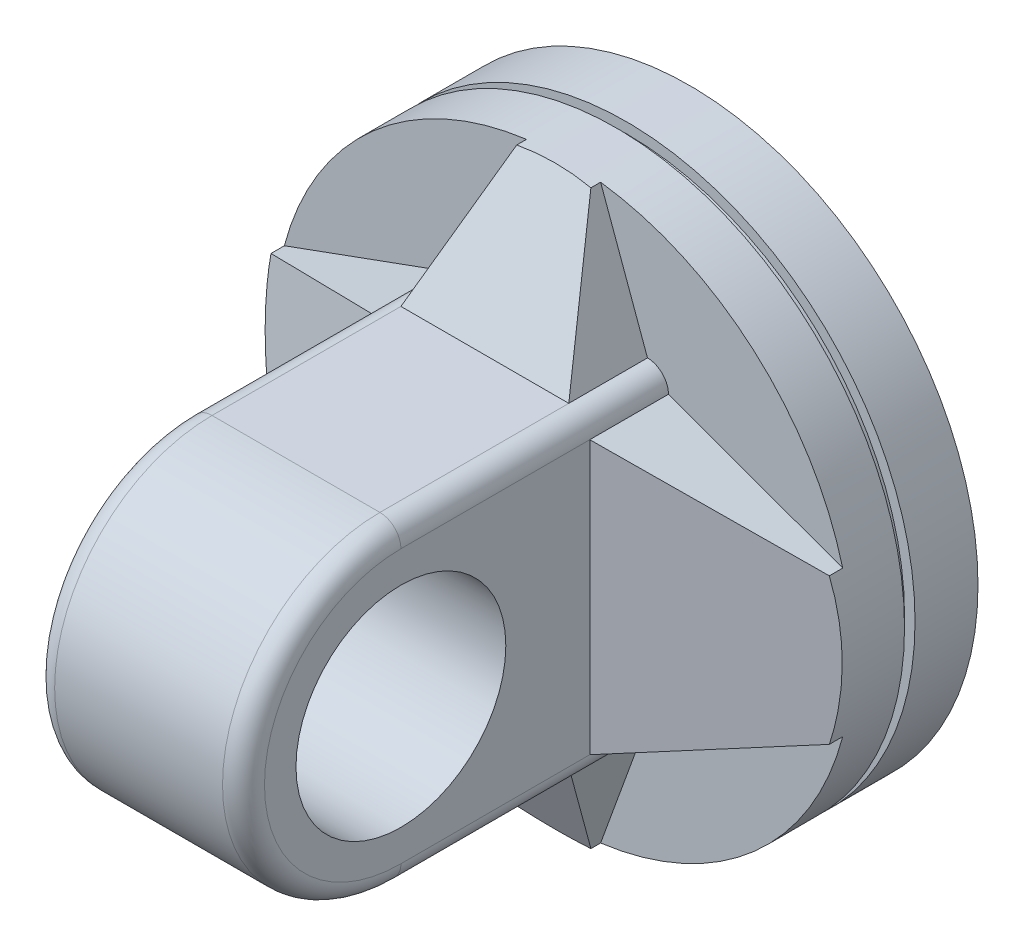
ISO-10303-21;
HEADER;
FILE_DESCRIPTION(('STEP AP214'),'2;1');
FILE_NAME('part.step','',(''),(''),'','','');
FILE_SCHEMA(('AUTOMOTIVE_DESIGN { 1 0 10303 214 1 1 1 1 }'));
ENDSEC;
DATA;
#1=APPLICATION_CONTEXT('core data for automotive mechanical design processes');
#2=APPLICATION_PROTOCOL_DEFINITION('international standard','automotive_design',2000,#1);
#3=PRODUCT_CONTEXT('',#1,'mechanical');
#4=PRODUCT('Part','Part','',(#3));
#5=PRODUCT_RELATED_PRODUCT_CATEGORY('part','',(#4));
#6=PRODUCT_DEFINITION_FORMATION('','',#4);
#7=PRODUCT_DEFINITION_CONTEXT('part definition',#1,'design');
#8=PRODUCT_DEFINITION('design','',#6,#7);
#9=PRODUCT_DEFINITION_SHAPE('','',#8);
#10=(LENGTH_UNIT() NAMED_UNIT(*) SI_UNIT(.MILLI.,.METRE.));
#11=(NAMED_UNIT(*) PLANE_ANGLE_UNIT() SI_UNIT($,.RADIAN.));
#12=(NAMED_UNIT(*) SI_UNIT($,.STERADIAN.) SOLID_ANGLE_UNIT());
#13=UNCERTAINTY_MEASURE_WITH_UNIT(LENGTH_MEASURE(1.E-05),#10,'distance_accuracy_value','');
#14=(GEOMETRIC_REPRESENTATION_CONTEXT(3) GLOBAL_UNCERTAINTY_ASSIGNED_CONTEXT((#13)) GLOBAL_UNIT_ASSIGNED_CONTEXT((#10,
#11,#12)) REPRESENTATION_CONTEXT('',''));
#15=CARTESIAN_POINT('',(0.,0.,0.));
#16=DIRECTION('',(0.,0.,1.));
#17=DIRECTION('',(1.,0.,0.));
#18=AXIS2_PLACEMENT_3D('',#15,#16,#17);
#19=CARTESIAN_POINT('',(0.,0.,120.));
#20=DIRECTION('',(0.,0.,1.));
#21=DIRECTION('',(1.,0.,0.));
#22=AXIS2_PLACEMENT_3D('',#19,#20,#21);
#23=PLANE('',#22);
#24=CARTESIAN_POINT('',(0.,0.,120.));
#25=DIRECTION('',(0.,0.,1.));
#26=DIRECTION('',(1.,0.,0.));
#27=AXIS2_PLACEMENT_3D('',#24,#25,#26);
#28=CIRCLE('',#27,275.);
#29=CARTESIAN_POINT('',(-266.057108102886,-69.5601554622265,120.));
#30=VERTEX_POINT('',#29);
#31=CARTESIAN_POINT('',(-35.3333345813136,-272.720654640174,120.));
#32=VERTEX_POINT('',#31);
#33=EDGE_CURVE('E270',#30,#32,#28,.T.);
#34=ORIENTED_EDGE('',*,*,#33,.T.);
#35=DIRECTION('',(0.342020143325671,-0.939692620785907,0.));
#36=VECTOR('',#35,1.);
#37=CARTESIAN_POINT('',(-118.85084845125,-43.2581711535386,120.));
#38=LINE('',#37,#36);
#39=CARTESIAN_POINT('',(-80.,-150.,120.));
#40=VERTEX_POINT('',#39);
#41=EDGE_CURVE('E183',#40,#32,#38,.T.);
#42=ORIENTED_EDGE('',*,*,#41,.F.);
#43=CARTESIAN_POINT('',(-80.,-130.,120.));
#44=DIRECTION('',(0.,0.,1.));
#45=DIRECTION('',(1.,0.,0.));
#46=AXIS2_PLACEMENT_3D('',#43,#44,#45);
#47=CIRCLE('',#46,20.);
#48=CARTESIAN_POINT('',(-100.,-130.,120.));
#49=VERTEX_POINT('',#48);
#50=EDGE_CURVE('E11',#40,#49,#47,.F.);
#51=ORIENTED_EDGE('',*,*,#50,.T.);
#52=DIRECTION('',(-0.939692620785912,0.34202014332566,0.));
#53=VECTOR('',#52,1.);
#54=CARTESIAN_POINT('',(-53.4789724736748,-146.932269287061,120.));
#55=LINE('',#54,#53);
#56=EDGE_CURVE('E348',#49,#30,#55,.T.);
#57=ORIENTED_EDGE('',*,*,#56,.T.);
#58=EDGE_LOOP('',(#34,#42,#51,#57));
#59=FACE_BOUND('',#58,.T.);
#60=ADVANCED_FACE('F34',(#59),#23,.T.);
#61=CARTESIAN_POINT('',(266.057108102887,69.5601554622248,120.));
#62=VERTEX_POINT('',#61);
#63=CARTESIAN_POINT('',(35.3333345813155,272.720654640174,120.));
#64=VERTEX_POINT('',#63);
#65=EDGE_CURVE('E274',#62,#64,#28,.T.);
#66=ORIENTED_EDGE('',*,*,#65,.T.);
#67=DIRECTION('',(-0.342020143325665,0.93969262078591,0.));
#68=VECTOR('',#67,1.);
#69=CARTESIAN_POINT('',(118.85084845125,43.2581711535378,120.));
#70=LINE('',#69,#68);
#71=CARTESIAN_POINT('',(80.,150.,120.));
#72=VERTEX_POINT('',#71);
#73=EDGE_CURVE('E318',#72,#64,#70,.T.);
#74=ORIENTED_EDGE('',*,*,#73,.F.);
#75=CARTESIAN_POINT('',(80.,130.,120.));
#76=DIRECTION('',(0.,0.,1.));
#77=DIRECTION('',(1.,0.,0.));
#78=AXIS2_PLACEMENT_3D('',#75,#76,#77);
#79=CIRCLE('',#78,20.);
#80=CARTESIAN_POINT('',(100.,130.,120.));
#81=VERTEX_POINT('',#80);
#82=EDGE_CURVE('E230',#72,#81,#79,.F.);
#83=ORIENTED_EDGE('',*,*,#82,.T.);
#84=DIRECTION('',(0.939692620785909,-0.342020143325666,0.));
#85=VECTOR('',#84,1.);
#86=CARTESIAN_POINT('',(53.4789724736758,146.932269287061,120.));
#87=LINE('',#86,#85);
#88=EDGE_CURVE('E330',#81,#62,#87,.T.);
#89=ORIENTED_EDGE('',*,*,#88,.T.);
#90=EDGE_LOOP('',(#66,#74,#83,#89));
#91=FACE_BOUND('',#90,.T.);
#92=ADVANCED_FACE('F377',(#91),#23,.T.);
#93=DIRECTION('',(-0.342020143325665,-0.93969262078591,0.));
#94=VECTOR('',#93,1.);
#95=CARTESIAN_POINT('',(118.85084845125,-43.2581711535378,120.));
#96=LINE('',#95,#94);
#97=CARTESIAN_POINT('',(80.,-150.,120.));
#98=VERTEX_POINT('',#97);
#99=CARTESIAN_POINT('',(35.3333345813155,-272.720654640174,120.));
#100=VERTEX_POINT('',#99);
#101=EDGE_CURVE('E397',#98,#100,#96,.T.);
#102=ORIENTED_EDGE('',*,*,#101,.T.);
#103=CARTESIAN_POINT('',(266.057108102887,-69.5601554622248,120.));
#104=VERTEX_POINT('',#103);
#105=EDGE_CURVE('E273',#100,#104,#28,.T.);
#106=ORIENTED_EDGE('',*,*,#105,.T.);
#107=DIRECTION('',(0.939692620785909,0.342020143325666,0.));
#108=VECTOR('',#107,1.);
#109=CARTESIAN_POINT('',(53.4789724736758,-146.932269287061,120.));
#110=LINE('',#109,#108);
#111=CARTESIAN_POINT('',(100.,-130.,120.));
#112=VERTEX_POINT('',#111);
#113=EDGE_CURVE('E334',#112,#104,#110,.T.);
#114=ORIENTED_EDGE('',*,*,#113,.F.);
#115=CARTESIAN_POINT('',(80.,-130.,120.));
#116=DIRECTION('',(0.,0.,1.));
#117=DIRECTION('',(1.,0.,0.));
#118=AXIS2_PLACEMENT_3D('',#115,#116,#117);
#119=CIRCLE('',#118,20.);
#120=EDGE_CURVE('E232',#112,#98,#119,.F.);
#121=ORIENTED_EDGE('',*,*,#120,.T.);
#122=EDGE_LOOP('',(#102,#106,#114,#121));
#123=FACE_BOUND('',#122,.T.);
#124=ADVANCED_FACE('F382',(#123),#23,.T.);
#125=DIRECTION('',(0.342020143325671,0.939692620785907,0.));
#126=VECTOR('',#125,1.);
#127=CARTESIAN_POINT('',(-118.85084845125,43.2581711535386,120.));
#128=LINE('',#127,#126);
#129=CARTESIAN_POINT('',(-80.,150.,120.));
#130=VERTEX_POINT('',#129);
#131=CARTESIAN_POINT('',(-35.3333345813136,272.720654640174,120.));
#132=VERTEX_POINT('',#131);
#133=EDGE_CURVE('E200',#130,#132,#128,.T.);
#134=ORIENTED_EDGE('',*,*,#133,.T.);
#135=CARTESIAN_POINT('',(-266.057108102887,69.5601554622229,120.));
#136=VERTEX_POINT('',#135);
#137=EDGE_CURVE('E277',#132,#136,#28,.T.);
#138=ORIENTED_EDGE('',*,*,#137,.T.);
#139=DIRECTION('',(-0.939692620785907,-0.342020143325672,0.));
#140=VECTOR('',#139,1.);
#141=CARTESIAN_POINT('',(-53.4789724736765,146.93226928706,120.));
#142=LINE('',#141,#140);
#143=CARTESIAN_POINT('',(-100.,130.,120.));
#144=VERTEX_POINT('',#143);
#145=EDGE_CURVE('E345',#144,#136,#142,.T.);
#146=ORIENTED_EDGE('',*,*,#145,.F.);
#147=CARTESIAN_POINT('',(-80.,130.,120.));
#148=DIRECTION('',(0.,0.,1.));
#149=DIRECTION('',(1.,0.,0.));
#150=AXIS2_PLACEMENT_3D('',#147,#148,#149);
#151=CIRCLE('',#150,20.);
#152=EDGE_CURVE('E43',#144,#130,#151,.F.);
#153=ORIENTED_EDGE('',*,*,#152,.T.);
#154=EDGE_LOOP('',(#134,#138,#146,#153));
#155=FACE_BOUND('',#154,.T.);
#156=ADVANCED_FACE('F378',(#155),#23,.T.);
#157=CARTESIAN_POINT('',(0.,0.,70.));
#158=DIRECTION('',(0.,0.,-1.));
#159=DIRECTION('',(-1.,0.,0.));
#160=AXIS2_PLACEMENT_3D('',#157,#158,#159);
#161=CYLINDRICAL_SURFACE('',#160,275.);
#162=CARTESIAN_POINT('',(0.,0.,0.));
#163=DIRECTION('',(0.,0.,1.));
#164=DIRECTION('',(1.,0.,0.));
#165=AXIS2_PLACEMENT_3D('',#162,#163,#164);
#166=CIRCLE('',#165,275.);
#167=CARTESIAN_POINT('',(275.,0.,0.));
#168=VERTEX_POINT('',#167);
#169=EDGE_CURVE('E286',#168,#168,#166,.T.);
#170=ORIENTED_EDGE('',*,*,#169,.T.);
#171=EDGE_LOOP('',(#170));
#172=FACE_BOUND('',#171,.T.);
#173=CARTESIAN_POINT('',(0.,0.,60.));
#174=DIRECTION('',(0.,0.,1.));
#175=DIRECTION('',(1.,0.,0.));
#176=AXIS2_PLACEMENT_3D('',#173,#174,#175);
#177=CIRCLE('',#176,275.);
#178=CARTESIAN_POINT('',(275.,0.,60.));
#179=VERTEX_POINT('',#178);
#180=EDGE_CURVE('E281',#179,#179,#177,.T.);
#181=ORIENTED_EDGE('',*,*,#180,.F.);
#182=EDGE_LOOP('',(#181));
#183=FACE_BOUND('',#182,.T.);
#184=ADVANCED_FACE('F385',(#172,#183),#161,.T.);
#185=CARTESIAN_POINT('',(0.,0.,0.));
#186=DIRECTION('',(0.,0.,1.));
#187=DIRECTION('',(1.,0.,0.));
#188=AXIS2_PLACEMENT_3D('',#185,#186,#187);
#189=PLANE('',#188);
#190=ORIENTED_EDGE('',*,*,#169,.F.);
#191=EDGE_LOOP('',(#190));
#192=FACE_BOUND('',#191,.T.);
#193=ADVANCED_FACE('F390',(#192),#189,.F.);
#194=CARTESIAN_POINT('',(0.,0.,60.));
#195=DIRECTION('',(0.,0.,1.));
#196=DIRECTION('',(1.,0.,0.));
#197=AXIS2_PLACEMENT_3D('',#194,#195,#196);
#198=PLANE('',#197);
#199=CARTESIAN_POINT('',(0.,0.,60.));
#200=DIRECTION('',(0.,0.,1.));
#201=DIRECTION('',(1.,0.,0.));
#202=AXIS2_PLACEMENT_3D('',#199,#200,#201);
#203=CIRCLE('',#202,265.);
#204=CARTESIAN_POINT('',(265.,0.,60.));
#205=VERTEX_POINT('',#204);
#206=EDGE_CURVE('E278',#205,#205,#203,.T.);
#207=ORIENTED_EDGE('',*,*,#206,.F.);
#208=EDGE_LOOP('',(#207));
#209=FACE_BOUND('',#208,.T.);
#210=ORIENTED_EDGE('',*,*,#180,.T.);
#211=EDGE_LOOP('',(#210));
#212=FACE_BOUND('',#211,.T.);
#213=ADVANCED_FACE('F693',(#209,#212),#198,.T.);
#214=CARTESIAN_POINT('',(0.,0.,60.));
#215=DIRECTION('',(0.,0.,1.));
#216=DIRECTION('',(1.,0.,0.));
#217=AXIS2_PLACEMENT_3D('',#214,#215,#216);
#218=CYLINDRICAL_SURFACE('',#217,265.);
#219=ORIENTED_EDGE('',*,*,#206,.T.);
#220=EDGE_LOOP('',(#219));
#221=FACE_BOUND('',#220,.T.);
#222=CARTESIAN_POINT('',(0.,0.,70.));
#223=DIRECTION('',(0.,0.,1.));
#224=DIRECTION('',(1.,0.,0.));
#225=AXIS2_PLACEMENT_3D('',#222,#223,#224);
#226=CIRCLE('',#225,265.);
#227=CARTESIAN_POINT('',(265.,0.,70.));
#228=VERTEX_POINT('',#227);
#229=EDGE_CURVE('E272',#228,#228,#226,.T.);
#230=ORIENTED_EDGE('',*,*,#229,.F.);
#231=EDGE_LOOP('',(#230));
#232=FACE_BOUND('',#231,.T.);
#233=ADVANCED_FACE('F364',(#221,#232),#218,.T.);
#234=CARTESIAN_POINT('',(0.,0.,120.));
#235=DIRECTION('',(0.,0.,-1.));
#236=DIRECTION('',(-1.,0.,0.));
#237=AXIS2_PLACEMENT_3D('',#234,#235,#236);
#238=CYLINDRICAL_SURFACE('',#237,275.);
#239=DIRECTION('',(0.,0.,-1.));
#240=VECTOR('',#239,1.);
#241=CARTESIAN_POINT('',(-35.3333345813136,272.720654640174,195.));
#242=LINE('',#241,#240);
#243=CARTESIAN_POINT('',(-35.3333345813136,272.720654640174,129.25679215705));
#244=VERTEX_POINT('',#243);
#245=EDGE_CURVE('E314',#244,#132,#242,.T.);
#246=ORIENTED_EDGE('',*,*,#245,.F.);
#247=CARTESIAN_POINT('',(0.,0.,275.357142857143));
#248=DIRECTION('',(0.,-0.472221412515419,-0.881479970028782));
#249=DIRECTION('',(0.,0.881479970028782,-0.472221412515419));
#250=AXIS2_PLACEMENT_3D('',#247,#248,#249);
#251=ELLIPSE('',#250,311.975324851705,275.);
#252=CARTESIAN_POINT('',(35.3333345813155,272.720654640174,129.25679215705));
#253=VERTEX_POINT('',#252);
#254=EDGE_CURVE('E426',#244,#253,#251,.T.);
#255=ORIENTED_EDGE('',*,*,#254,.T.);
#256=DIRECTION('',(0.,0.,-1.));
#257=VECTOR('',#256,1.);
#258=CARTESIAN_POINT('',(35.3333345813155,272.720654640174,195.));
#259=LINE('',#258,#257);
#260=EDGE_CURVE('E325',#253,#64,#259,.T.);
#261=ORIENTED_EDGE('',*,*,#260,.T.);
#262=ORIENTED_EDGE('',*,*,#65,.F.);
#263=DIRECTION('',(0.,0.,-1.));
#264=VECTOR('',#263,1.);
#265=CARTESIAN_POINT('',(266.057108102887,69.5601554622248,195.));
#266=LINE('',#265,#264);
#267=CARTESIAN_POINT('',(266.057108102887,69.5601554622248,132.728584461418));
#268=VERTEX_POINT('',#267);
#269=EDGE_CURVE('E333',#268,#62,#266,.T.);
#270=ORIENTED_EDGE('',*,*,#269,.F.);
#271=CARTESIAN_POINT('',(0.,0.,232.5));
#272=DIRECTION('',(-0.351123441588391,0.,-0.936329177569045));
#273=DIRECTION('',(0.936329177569045,0.,-0.351123441588391));
#274=AXIS2_PLACEMENT_3D('',#271,#272,#273);
#275=ELLIPSE('',#274,293.70012874529,275.);
#276=CARTESIAN_POINT('',(266.057108102887,-69.5601554622248,132.728584461418));
#277=VERTEX_POINT('',#276);
#278=EDGE_CURVE('E419',#268,#277,#275,.T.);
#279=ORIENTED_EDGE('',*,*,#278,.T.);
#280=DIRECTION('',(0.,0.,-1.));
#281=VECTOR('',#280,1.);
#282=CARTESIAN_POINT('',(266.057108102887,-69.5601554622248,195.));
#283=LINE('',#282,#281);
#284=EDGE_CURVE('E340',#277,#104,#283,.T.);
#285=ORIENTED_EDGE('',*,*,#284,.T.);
#286=ORIENTED_EDGE('',*,*,#105,.F.);
#287=DIRECTION('',(0.,0.,-1.));
#288=VECTOR('',#287,1.);
#289=CARTESIAN_POINT('',(35.3333345813155,-272.720654640174,195.));
#290=LINE('',#289,#288);
#291=CARTESIAN_POINT('',(35.3333345813155,-272.720654640174,129.25679215705));
#292=VERTEX_POINT('',#291);
#293=EDGE_CURVE('E51',#292,#100,#290,.T.);
#294=ORIENTED_EDGE('',*,*,#293,.F.);
#295=CARTESIAN_POINT('',(0.,0.,275.357142857143));
#296=DIRECTION('',(0.,0.472221412515419,-0.881479970028782));
#297=DIRECTION('',(0.,-0.881479970028782,-0.472221412515419));
#298=AXIS2_PLACEMENT_3D('',#295,#296,#297);
#299=ELLIPSE('',#298,311.975324851705,275.);
#300=CARTESIAN_POINT('',(-35.3333345813136,-272.720654640174,129.25679215705));
#301=VERTEX_POINT('',#300);
#302=EDGE_CURVE('E191',#292,#301,#299,.T.);
#303=ORIENTED_EDGE('',*,*,#302,.T.);
#304=DIRECTION('',(0.,0.,-1.));
#305=VECTOR('',#304,1.);
#306=CARTESIAN_POINT('',(-35.3333345813136,-272.720654640174,195.));
#307=LINE('',#306,#305);
#308=EDGE_CURVE('E59',#301,#32,#307,.T.);
#309=ORIENTED_EDGE('',*,*,#308,.T.);
#310=ORIENTED_EDGE('',*,*,#33,.F.);
#311=DIRECTION('',(0.,0.,-1.));
#312=VECTOR('',#311,1.);
#313=CARTESIAN_POINT('',(-266.057108102886,-69.5601554622265,195.));
#314=LINE('',#313,#312);
#315=CARTESIAN_POINT('',(-266.057108102886,-69.5601554622265,132.728584461418));
#316=VERTEX_POINT('',#315);
#317=EDGE_CURVE('E256',#316,#30,#314,.T.);
#318=ORIENTED_EDGE('',*,*,#317,.F.);
#319=CARTESIAN_POINT('',(0.,0.,232.5));
#320=DIRECTION('',(0.351123441588391,0.,-0.936329177569045));
#321=DIRECTION('',(-0.936329177569045,0.,-0.351123441588391));
#322=AXIS2_PLACEMENT_3D('',#319,#320,#321);
#323=ELLIPSE('',#322,293.70012874529,275.);
#324=CARTESIAN_POINT('',(-266.057108102887,69.5601554622229,132.728584461417));
#325=VERTEX_POINT('',#324);
#326=EDGE_CURVE('E408',#316,#325,#323,.T.);
#327=ORIENTED_EDGE('',*,*,#326,.T.);
#328=DIRECTION('',(0.,0.,-1.));
#329=VECTOR('',#328,1.);
#330=CARTESIAN_POINT('',(-266.057108102887,69.5601554622229,195.));
#331=LINE('',#330,#329);
#332=EDGE_CURVE('E250',#325,#136,#331,.T.);
#333=ORIENTED_EDGE('',*,*,#332,.T.);
#334=ORIENTED_EDGE('',*,*,#137,.F.);
#335=EDGE_LOOP('',(#246,#255,#261,#262,#270,#279,#285,#286,#294,#303,#309,#310,#318,#327,#333,#334));
#336=FACE_BOUND('',#335,.T.);
#337=CARTESIAN_POINT('',(0.,0.,70.));
#338=DIRECTION('',(0.,0.,1.));
#339=DIRECTION('',(1.,0.,0.));
#340=AXIS2_PLACEMENT_3D('',#337,#338,#339);
#341=CIRCLE('',#340,275.);
#342=CARTESIAN_POINT('',(275.,0.,70.));
#343=VERTEX_POINT('',#342);
#344=EDGE_CURVE('E269',#343,#343,#341,.T.);
#345=ORIENTED_EDGE('',*,*,#344,.T.);
#346=EDGE_LOOP('',(#345));
#347=FACE_BOUND('',#346,.T.);
#348=ADVANCED_FACE('F359',(#336,#347),#238,.T.);
#349=CARTESIAN_POINT('',(0.,0.,70.));
#350=DIRECTION('',(0.,0.,1.));
#351=DIRECTION('',(1.,0.,0.));
#352=AXIS2_PLACEMENT_3D('',#349,#350,#351);
#353=PLANE('',#352);
#354=ORIENTED_EDGE('',*,*,#229,.T.);
#355=EDGE_LOOP('',(#354));
#356=FACE_BOUND('',#355,.T.);
#357=ORIENTED_EDGE('',*,*,#344,.F.);
#358=EDGE_LOOP('',(#357));
#359=FACE_BOUND('',#358,.T.);
#360=ADVANCED_FACE('F363',(#356,#359),#353,.F.);
#361=CARTESIAN_POINT('',(100.,-150.,375.));
#362=DIRECTION('',(0.,1.,0.));
#363=DIRECTION('',(0.,0.,1.));
#364=AXIS2_PLACEMENT_3D('',#361,#362,#363);
#365=PLANE('',#364);
#366=DIRECTION('',(0.,0.,-1.));
#367=VECTOR('',#366,1.);
#368=CARTESIAN_POINT('',(-80.,-150.,375.));
#369=LINE('',#368,#367);
#370=CARTESIAN_POINT('',(-80.,-150.,375.));
#371=VERTEX_POINT('',#370);
#372=CARTESIAN_POINT('',(-80.,-150.,195.));
#373=VERTEX_POINT('',#372);
#374=EDGE_CURVE('E196',#371,#373,#369,.T.);
#375=ORIENTED_EDGE('',*,*,#374,.T.);
#376=DIRECTION('',(-1.,0.,0.));
#377=VECTOR('',#376,1.);
#378=CARTESIAN_POINT('',(0.,-150.,195.));
#379=LINE('',#378,#377);
#380=CARTESIAN_POINT('',(80.,-150.,195.));
#381=VERTEX_POINT('',#380);
#382=EDGE_CURVE('E175',#381,#373,#379,.T.);
#383=ORIENTED_EDGE('',*,*,#382,.F.);
#384=DIRECTION('',(0.,0.,-1.));
#385=VECTOR('',#384,1.);
#386=CARTESIAN_POINT('',(80.,-150.,375.));
#387=LINE('',#386,#385);
#388=CARTESIAN_POINT('',(80.,-150.,375.));
#389=VERTEX_POINT('',#388);
#390=EDGE_CURVE('E206',#381,#389,#387,.F.);
#391=ORIENTED_EDGE('',*,*,#390,.T.);
#392=DIRECTION('',(-1.,0.,0.));
#393=VECTOR('',#392,1.);
#394=CARTESIAN_POINT('',(100.,-150.,375.));
#395=LINE('',#394,#393);
#396=EDGE_CURVE('E205',#389,#371,#395,.T.);
#397=ORIENTED_EDGE('',*,*,#396,.T.);
#398=EDGE_LOOP('',(#375,#383,#391,#397));
#399=FACE_BOUND('',#398,.T.);
#400=ADVANCED_FACE('F203',(#399),#365,.F.);
#401=CARTESIAN_POINT('',(100.,150.,375.));
#402=DIRECTION('',(0.,-1.,0.));
#403=DIRECTION('',(0.,0.,-1.));
#404=AXIS2_PLACEMENT_3D('',#401,#402,#403);
#405=PLANE('',#404);
#406=DIRECTION('',(0.,0.,1.));
#407=VECTOR('',#406,1.);
#408=CARTESIAN_POINT('',(80.,150.,120.));
#409=LINE('',#408,#407);
#410=CARTESIAN_POINT('',(80.,150.,375.));
#411=VERTEX_POINT('',#410);
#412=CARTESIAN_POINT('',(80.,150.,195.));
#413=VERTEX_POINT('',#412);
#414=EDGE_CURVE('E207',#411,#413,#409,.F.);
#415=ORIENTED_EDGE('',*,*,#414,.T.);
#416=DIRECTION('',(1.,0.,0.));
#417=VECTOR('',#416,1.);
#418=CARTESIAN_POINT('',(0.,150.,195.));
#419=LINE('',#418,#417);
#420=CARTESIAN_POINT('',(-80.,150.,195.));
#421=VERTEX_POINT('',#420);
#422=EDGE_CURVE('E308',#421,#413,#419,.T.);
#423=ORIENTED_EDGE('',*,*,#422,.F.);
#424=DIRECTION('',(0.,0.,1.));
#425=VECTOR('',#424,1.);
#426=CARTESIAN_POINT('',(-80.,150.,375.));
#427=LINE('',#426,#425);
#428=CARTESIAN_POINT('',(-80.,150.,375.));
#429=VERTEX_POINT('',#428);
#430=EDGE_CURVE('E297',#421,#429,#427,.T.);
#431=ORIENTED_EDGE('',*,*,#430,.T.);
#432=DIRECTION('',(-1.,0.,0.));
#433=VECTOR('',#432,1.);
#434=CARTESIAN_POINT('',(100.,150.,375.));
#435=LINE('',#434,#433);
#436=EDGE_CURVE('E263',#411,#429,#435,.T.);
#437=ORIENTED_EDGE('',*,*,#436,.F.);
#438=EDGE_LOOP('',(#415,#423,#431,#437));
#439=FACE_BOUND('',#438,.T.);
#440=ADVANCED_FACE('F306',(#439),#405,.F.);
#441=CARTESIAN_POINT('',(100.,0.,375.));
#442=DIRECTION('',(1.,0.,0.));
#443=DIRECTION('',(0.,0.,-1.));
#444=AXIS2_PLACEMENT_3D('',#441,#442,#443);
#445=PLANE('',#444);
#446=DIRECTION('',(0.,-1.,0.));
#447=VECTOR('',#446,1.);
#448=CARTESIAN_POINT('',(100.,0.,195.));
#449=LINE('',#448,#447);
#450=CARTESIAN_POINT('',(100.,130.,195.));
#451=VERTEX_POINT('',#450);
#452=CARTESIAN_POINT('',(100.,-130.,195.));
#453=VERTEX_POINT('',#452);
#454=EDGE_CURVE('E331',#451,#453,#449,.T.);
#455=ORIENTED_EDGE('',*,*,#454,.F.);
#456=DIRECTION('',(0.,0.,1.));
#457=VECTOR('',#456,1.);
#458=CARTESIAN_POINT('',(100.,130.,375.));
#459=LINE('',#458,#457);
#460=CARTESIAN_POINT('',(100.,130.,375.));
#461=VERTEX_POINT('',#460);
#462=EDGE_CURVE('E294',#451,#461,#459,.T.);
#463=ORIENTED_EDGE('',*,*,#462,.T.);
#464=CARTESIAN_POINT('',(100.,0.,375.));
#465=DIRECTION('',(1.,0.,0.));
#466=DIRECTION('',(0.,0.,-1.));
#467=AXIS2_PLACEMENT_3D('',#464,#465,#466);
#468=CIRCLE('',#467,130.);
#469=CARTESIAN_POINT('',(100.,-130.,375.));
#470=VERTEX_POINT('',#469);
#471=EDGE_CURVE('E289',#461,#470,#468,.T.);
#472=ORIENTED_EDGE('',*,*,#471,.T.);
#473=DIRECTION('',(0.,0.,-1.));
#474=VECTOR('',#473,1.);
#475=CARTESIAN_POINT('',(100.,-130.,120.));
#476=LINE('',#475,#474);
#477=EDGE_CURVE('E291',#470,#453,#476,.T.);
#478=ORIENTED_EDGE('',*,*,#477,.T.);
#479=EDGE_LOOP('',(#455,#463,#472,#478));
#480=FACE_BOUND('',#479,.T.);
#481=CARTESIAN_POINT('',(100.,0.,375.));
#482=DIRECTION('',(1.,0.,0.));
#483=DIRECTION('',(0.,0.,-1.));
#484=AXIS2_PLACEMENT_3D('',#481,#482,#483);
#485=CIRCLE('',#484,100.);
#486=CARTESIAN_POINT('',(100.,0.,275.));
#487=VERTEX_POINT('',#486);
#488=EDGE_CURVE('E260',#487,#487,#485,.T.);
#489=ORIENTED_EDGE('',*,*,#488,.F.);
#490=EDGE_LOOP('',(#489));
#491=FACE_BOUND('',#490,.T.);
#492=ADVANCED_FACE('F491',(#480,#491),#445,.T.);
#493=CARTESIAN_POINT('',(-100.,0.,375.));
#494=DIRECTION('',(1.,0.,0.));
#495=DIRECTION('',(0.,0.,-1.));
#496=AXIS2_PLACEMENT_3D('',#493,#494,#495);
#497=PLANE('',#496);
#498=DIRECTION('',(0.,0.,1.));
#499=VECTOR('',#498,1.);
#500=CARTESIAN_POINT('',(-100.,130.,375.));
#501=LINE('',#500,#499);
#502=CARTESIAN_POINT('',(-100.,130.,375.));
#503=VERTEX_POINT('',#502);
#504=CARTESIAN_POINT('',(-100.,130.,195.));
#505=VERTEX_POINT('',#504);
#506=EDGE_CURVE('E223',#503,#505,#501,.F.);
#507=ORIENTED_EDGE('',*,*,#506,.T.);
#508=DIRECTION('',(0.,1.,0.));
#509=VECTOR('',#508,1.);
#510=CARTESIAN_POINT('',(-100.,0.,195.));
#511=LINE('',#510,#509);
#512=CARTESIAN_POINT('',(-100.,-130.,195.));
#513=VERTEX_POINT('',#512);
#514=EDGE_CURVE('E346',#513,#505,#511,.T.);
#515=ORIENTED_EDGE('',*,*,#514,.F.);
#516=DIRECTION('',(0.,0.,-1.));
#517=VECTOR('',#516,1.);
#518=CARTESIAN_POINT('',(-100.,-130.,375.));
#519=LINE('',#518,#517);
#520=CARTESIAN_POINT('',(-100.,-130.,375.));
#521=VERTEX_POINT('',#520);
#522=EDGE_CURVE('E219',#513,#521,#519,.F.);
#523=ORIENTED_EDGE('',*,*,#522,.T.);
#524=CARTESIAN_POINT('',(-100.,0.,375.));
#525=DIRECTION('',(1.,0.,0.));
#526=DIRECTION('',(0.,0.,-1.));
#527=AXIS2_PLACEMENT_3D('',#524,#525,#526);
#528=CIRCLE('',#527,130.);
#529=EDGE_CURVE('E217',#521,#503,#528,.F.);
#530=ORIENTED_EDGE('',*,*,#529,.T.);
#531=EDGE_LOOP('',(#507,#515,#523,#530));
#532=FACE_BOUND('',#531,.T.);
#533=CARTESIAN_POINT('',(-100.,0.,375.));
#534=DIRECTION('',(1.,0.,0.));
#535=DIRECTION('',(0.,0.,-1.));
#536=AXIS2_PLACEMENT_3D('',#533,#534,#535);
#537=CIRCLE('',#536,100.);
#538=CARTESIAN_POINT('',(-100.,0.,275.));
#539=VERTEX_POINT('',#538);
#540=EDGE_CURVE('E240',#539,#539,#537,.T.);
#541=ORIENTED_EDGE('',*,*,#540,.T.);
#542=EDGE_LOOP('',(#541));
#543=FACE_BOUND('',#542,.T.);
#544=ADVANCED_FACE('F447',(#532,#543),#497,.F.);
#545=CARTESIAN_POINT('',(100.,0.,375.));
#546=DIRECTION('',(-1.,0.,0.));
#547=DIRECTION('',(0.,0.,1.));
#548=AXIS2_PLACEMENT_3D('',#545,#546,#547);
#549=CYLINDRICAL_SURFACE('',#548,150.);
#550=ORIENTED_EDGE('',*,*,#396,.F.);
#551=CARTESIAN_POINT('',(80.,0.,375.));
#552=DIRECTION('',(1.,0.,0.));
#553=DIRECTION('',(0.,0.,-1.));
#554=AXIS2_PLACEMENT_3D('',#551,#552,#553);
#555=CIRCLE('',#554,150.);
#556=EDGE_CURVE('E228',#389,#411,#555,.F.);
#557=ORIENTED_EDGE('',*,*,#556,.T.);
#558=ORIENTED_EDGE('',*,*,#436,.T.);
#559=CARTESIAN_POINT('',(-80.,0.,375.));
#560=DIRECTION('',(1.,0.,0.));
#561=DIRECTION('',(0.,0.,-1.));
#562=AXIS2_PLACEMENT_3D('',#559,#560,#561);
#563=CIRCLE('',#562,150.);
#564=EDGE_CURVE('E226',#429,#371,#563,.T.);
#565=ORIENTED_EDGE('',*,*,#564,.T.);
#566=EDGE_LOOP('',(#550,#557,#558,#565));
#567=FACE_BOUND('',#566,.T.);
#568=ADVANCED_FACE('F440',(#567),#549,.T.);
#569=CARTESIAN_POINT('',(100.,0.,375.));
#570=DIRECTION('',(-1.,0.,0.));
#571=DIRECTION('',(0.,0.,1.));
#572=AXIS2_PLACEMENT_3D('',#569,#570,#571);
#573=CYLINDRICAL_SURFACE('',#572,100.);
#574=ORIENTED_EDGE('',*,*,#488,.T.);
#575=EDGE_LOOP('',(#574));
#576=FACE_BOUND('',#575,.T.);
#577=ORIENTED_EDGE('',*,*,#540,.F.);
#578=EDGE_LOOP('',(#577));
#579=FACE_BOUND('',#578,.T.);
#580=ADVANCED_FACE('F487',(#576,#579),#573,.F.);
#581=CARTESIAN_POINT('',(80.,-130.,375.));
#582=DIRECTION('',(0.,0.,1.));
#583=DIRECTION('',(0.,-1.,0.));
#584=AXIS2_PLACEMENT_3D('',#581,#582,#583);
#585=CYLINDRICAL_SURFACE('',#584,20.);
#586=ORIENTED_EDGE('',*,*,#120,.F.);
#587=DIRECTION('',(0.,0.,-1.));
#588=VECTOR('',#587,1.);
#589=CARTESIAN_POINT('',(100.,-130.,195.));
#590=LINE('',#589,#588);
#591=EDGE_CURVE('E342',#453,#112,#590,.T.);
#592=ORIENTED_EDGE('',*,*,#591,.F.);
#593=ORIENTED_EDGE('',*,*,#477,.F.);
#594=CARTESIAN_POINT('',(80.,-130.,375.));
#595=DIRECTION('',(0.,0.,1.));
#596=DIRECTION('',(1.,0.,0.));
#597=AXIS2_PLACEMENT_3D('',#594,#595,#596);
#598=CIRCLE('',#597,20.);
#599=EDGE_CURVE('E238',#389,#470,#598,.T.);
#600=ORIENTED_EDGE('',*,*,#599,.F.);
#601=ORIENTED_EDGE('',*,*,#390,.F.);
#602=EDGE_CURVE('E209',#98,#381,#387,.F.);
#603=ORIENTED_EDGE('',*,*,#602,.F.);
#604=EDGE_LOOP('',(#586,#592,#593,#600,#601,#603));
#605=FACE_BOUND('',#604,.T.);
#606=ADVANCED_FACE('F434',(#605),#585,.T.);
#607=CARTESIAN_POINT('',(80.,0.,375.));
#608=DIRECTION('',(1.,0.,0.));
#609=DIRECTION('',(0.,0.,-1.));
#610=AXIS2_PLACEMENT_3D('',#607,#608,#609);
#611=TOROIDAL_SURFACE('',#610,130.,20.);
#612=ORIENTED_EDGE('',*,*,#599,.T.);
#613=ORIENTED_EDGE('',*,*,#471,.F.);
#614=CARTESIAN_POINT('',(80.,130.,375.));
#615=DIRECTION('',(0.,0.,-1.));
#616=DIRECTION('',(-1.,0.,0.));
#617=AXIS2_PLACEMENT_3D('',#614,#615,#616);
#618=CIRCLE('',#617,20.);
#619=EDGE_CURVE('E235',#411,#461,#618,.T.);
#620=ORIENTED_EDGE('',*,*,#619,.F.);
#621=ORIENTED_EDGE('',*,*,#556,.F.);
#622=EDGE_LOOP('',(#612,#613,#620,#621));
#623=FACE_BOUND('',#622,.T.);
#624=ADVANCED_FACE('F526',(#623),#611,.T.);
#625=CARTESIAN_POINT('',(80.,130.,375.));
#626=DIRECTION('',(0.,0.,-1.));
#627=DIRECTION('',(0.,1.,0.));
#628=AXIS2_PLACEMENT_3D('',#625,#626,#627);
#629=CYLINDRICAL_SURFACE('',#628,20.);
#630=ORIENTED_EDGE('',*,*,#82,.F.);
#631=DIRECTION('',(0.,0.,-1.));
#632=VECTOR('',#631,1.);
#633=CARTESIAN_POINT('',(80.,150.,195.));
#634=LINE('',#633,#632);
#635=EDGE_CURVE('E327',#413,#72,#634,.T.);
#636=ORIENTED_EDGE('',*,*,#635,.F.);
#637=ORIENTED_EDGE('',*,*,#414,.F.);
#638=ORIENTED_EDGE('',*,*,#619,.T.);
#639=ORIENTED_EDGE('',*,*,#462,.F.);
#640=EDGE_CURVE('E295',#81,#451,#459,.T.);
#641=ORIENTED_EDGE('',*,*,#640,.F.);
#642=EDGE_LOOP('',(#630,#636,#637,#638,#639,#641));
#643=FACE_BOUND('',#642,.T.);
#644=ADVANCED_FACE('F533',(#643),#629,.T.);
#645=CARTESIAN_POINT('',(-80.,-130.,375.));
#646=DIRECTION('',(0.,0.,-1.));
#647=DIRECTION('',(0.,1.,0.));
#648=AXIS2_PLACEMENT_3D('',#645,#646,#647);
#649=CYLINDRICAL_SURFACE('',#648,20.);
#650=ORIENTED_EDGE('',*,*,#50,.F.);
#651=DIRECTION('',(0.,0.,-1.));
#652=VECTOR('',#651,1.);
#653=CARTESIAN_POINT('',(-80.,-150.,195.));
#654=LINE('',#653,#652);
#655=EDGE_CURVE('E190',#373,#40,#654,.T.);
#656=ORIENTED_EDGE('',*,*,#655,.F.);
#657=ORIENTED_EDGE('',*,*,#374,.F.);
#658=CARTESIAN_POINT('',(-80.,-130.,375.));
#659=DIRECTION('',(0.,0.,1.));
#660=DIRECTION('',(1.,0.,0.));
#661=AXIS2_PLACEMENT_3D('',#658,#659,#660);
#662=CIRCLE('',#661,20.);
#663=EDGE_CURVE('E38',#521,#371,#662,.T.);
#664=ORIENTED_EDGE('',*,*,#663,.F.);
#665=ORIENTED_EDGE('',*,*,#522,.F.);
#666=EDGE_CURVE('E220',#49,#513,#519,.F.);
#667=ORIENTED_EDGE('',*,*,#666,.F.);
#668=EDGE_LOOP('',(#650,#656,#657,#664,#665,#667));
#669=FACE_BOUND('',#668,.T.);
#670=ADVANCED_FACE('F36',(#669),#649,.T.);
#671=CARTESIAN_POINT('',(-80.,0.,375.));
#672=DIRECTION('',(1.,0.,0.));
#673=DIRECTION('',(0.,0.,-1.));
#674=AXIS2_PLACEMENT_3D('',#671,#672,#673);
#675=TOROIDAL_SURFACE('',#674,130.,20.);
#676=ORIENTED_EDGE('',*,*,#663,.T.);
#677=ORIENTED_EDGE('',*,*,#564,.F.);
#678=CARTESIAN_POINT('',(-80.,130.,375.));
#679=DIRECTION('',(0.,0.,-1.));
#680=DIRECTION('',(-1.,0.,0.));
#681=AXIS2_PLACEMENT_3D('',#678,#679,#680);
#682=CIRCLE('',#681,20.);
#683=EDGE_CURVE('E241',#503,#429,#682,.T.);
#684=ORIENTED_EDGE('',*,*,#683,.F.);
#685=ORIENTED_EDGE('',*,*,#529,.F.);
#686=EDGE_LOOP('',(#676,#677,#684,#685));
#687=FACE_BOUND('',#686,.T.);
#688=ADVANCED_FACE('F442',(#687),#675,.T.);
#689=CARTESIAN_POINT('',(-80.,130.,375.));
#690=DIRECTION('',(0.,0.,1.));
#691=DIRECTION('',(0.,-1.,0.));
#692=AXIS2_PLACEMENT_3D('',#689,#690,#691);
#693=CYLINDRICAL_SURFACE('',#692,20.);
#694=ORIENTED_EDGE('',*,*,#152,.F.);
#695=DIRECTION('',(0.,0.,-1.));
#696=VECTOR('',#695,1.);
#697=CARTESIAN_POINT('',(-100.,130.,195.));
#698=LINE('',#697,#696);
#699=EDGE_CURVE('E243',#505,#144,#698,.T.);
#700=ORIENTED_EDGE('',*,*,#699,.F.);
#701=ORIENTED_EDGE('',*,*,#506,.F.);
#702=ORIENTED_EDGE('',*,*,#683,.T.);
#703=ORIENTED_EDGE('',*,*,#430,.F.);
#704=EDGE_CURVE('E212',#130,#421,#427,.T.);
#705=ORIENTED_EDGE('',*,*,#704,.F.);
#706=EDGE_LOOP('',(#694,#700,#701,#702,#703,#705));
#707=FACE_BOUND('',#706,.T.);
#708=ADVANCED_FACE('F309',(#707),#693,.T.);
#709=CARTESIAN_POINT('',(-53.4789724736765,146.93226928706,195.));
#710=DIRECTION('',(0.342020143325672,-0.939692620785907,0.));
#711=DIRECTION('',(0.939692620785907,0.342020143325672,0.));
#712=AXIS2_PLACEMENT_3D('',#709,#710,#711);
#713=PLANE('',#712);
#714=ORIENTED_EDGE('',*,*,#332,.F.);
#715=DIRECTION('',(0.886275726587317,0.322577983830438,0.332353397470243));
#716=VECTOR('',#715,1.);
#717=CARTESIAN_POINT('',(-58.6176284562633,145.061951465265,210.518389328901));
#718=LINE('',#717,#716);
#719=EDGE_CURVE('E401',#325,#505,#718,.T.);
#720=ORIENTED_EDGE('',*,*,#719,.T.);
#721=ORIENTED_EDGE('',*,*,#699,.T.);
#722=ORIENTED_EDGE('',*,*,#145,.T.);
#723=EDGE_LOOP('',(#714,#720,#721,#722));
#724=FACE_BOUND('',#723,.T.);
#725=ADVANCED_FACE('F407',(#724),#713,.F.);
#726=CARTESIAN_POINT('',(-53.4789724736748,-146.932269287061,195.));
#727=DIRECTION('',(-0.34202014332566,-0.939692620785911,0.));
#728=DIRECTION('',(0.939692620785912,-0.34202014332566,0.));
#729=AXIS2_PLACEMENT_3D('',#726,#727,#728);
#730=PLANE('',#729);
#731=DIRECTION('',(0.88627572658732,-0.322577983830427,0.332353397470245));
#732=VECTOR('',#731,1.);
#733=CARTESIAN_POINT('',(-58.6176284562618,-145.061951465265,210.518389328902));
#734=LINE('',#733,#732);
#735=EDGE_CURVE('E356',#316,#513,#734,.T.);
#736=ORIENTED_EDGE('',*,*,#735,.F.);
#737=ORIENTED_EDGE('',*,*,#317,.T.);
#738=ORIENTED_EDGE('',*,*,#56,.F.);
#739=ORIENTED_EDGE('',*,*,#666,.T.);
#740=EDGE_LOOP('',(#736,#737,#738,#739));
#741=FACE_BOUND('',#740,.T.);
#742=ADVANCED_FACE('F355',(#741),#730,.T.);
#743=CARTESIAN_POINT('',(53.4789724736758,146.932269287061,195.));
#744=DIRECTION('',(0.342020143325666,0.939692620785909,0.));
#745=DIRECTION('',(-0.939692620785909,0.342020143325666,0.));
#746=AXIS2_PLACEMENT_3D('',#743,#744,#745);
#747=PLANE('',#746);
#748=DIRECTION('',(-0.886275726587318,0.322577983830432,0.332353397470244));
#749=VECTOR('',#748,1.);
#750=CARTESIAN_POINT('',(58.6176284562627,145.061951465265,210.518389328902));
#751=LINE('',#750,#749);
#752=EDGE_CURVE('E412',#268,#451,#751,.T.);
#753=ORIENTED_EDGE('',*,*,#752,.F.);
#754=ORIENTED_EDGE('',*,*,#269,.T.);
#755=ORIENTED_EDGE('',*,*,#88,.F.);
#756=ORIENTED_EDGE('',*,*,#640,.T.);
#757=EDGE_LOOP('',(#753,#754,#755,#756));
#758=FACE_BOUND('',#757,.T.);
#759=ADVANCED_FACE('F476',(#758),#747,.T.);
#760=CARTESIAN_POINT('',(53.4789724736758,-146.932269287061,195.));
#761=DIRECTION('',(-0.342020143325666,0.939692620785909,0.));
#762=DIRECTION('',(-0.939692620785909,-0.342020143325666,0.));
#763=AXIS2_PLACEMENT_3D('',#760,#761,#762);
#764=PLANE('',#763);
#765=ORIENTED_EDGE('',*,*,#284,.F.);
#766=DIRECTION('',(-0.886275726587318,-0.322577983830432,0.332353397470244));
#767=VECTOR('',#766,1.);
#768=CARTESIAN_POINT('',(58.6176284562627,-145.061951465265,210.518389328902));
#769=LINE('',#768,#767);
#770=EDGE_CURVE('E421',#277,#453,#769,.T.);
#771=ORIENTED_EDGE('',*,*,#770,.T.);
#772=ORIENTED_EDGE('',*,*,#591,.T.);
#773=ORIENTED_EDGE('',*,*,#113,.T.);
#774=EDGE_LOOP('',(#765,#771,#772,#773));
#775=FACE_BOUND('',#774,.T.);
#776=ADVANCED_FACE('F473',(#775),#764,.F.);
#777=CARTESIAN_POINT('',(-118.85084845125,43.2581711535386,195.));
#778=DIRECTION('',(-0.939692620785907,0.342020143325671,0.));
#779=DIRECTION('',(-0.342020143325671,-0.939692620785907,0.));
#780=AXIS2_PLACEMENT_3D('',#777,#778,#779);
#781=PLANE('',#780);
#782=DIRECTION('',(-0.305494684054682,-0.839339746203657,0.449646292609102));
#783=VECTOR('',#782,1.);
#784=CARTESIAN_POINT('',(-110.9959144283,64.8394250128989,240.621736600233));
#785=LINE('',#784,#783);
#786=EDGE_CURVE('E424',#244,#421,#785,.T.);
#787=ORIENTED_EDGE('',*,*,#786,.F.);
#788=ORIENTED_EDGE('',*,*,#245,.T.);
#789=ORIENTED_EDGE('',*,*,#133,.F.);
#790=ORIENTED_EDGE('',*,*,#704,.T.);
#791=EDGE_LOOP('',(#787,#788,#789,#790));
#792=FACE_BOUND('',#791,.T.);
#793=ADVANCED_FACE('F312',(#792),#781,.T.);
#794=CARTESIAN_POINT('',(118.85084845125,43.2581711535378,195.));
#795=DIRECTION('',(-0.93969262078591,-0.342020143325665,0.));
#796=DIRECTION('',(0.342020143325665,-0.93969262078591,0.));
#797=AXIS2_PLACEMENT_3D('',#794,#795,#796);
#798=PLANE('',#797);
#799=ORIENTED_EDGE('',*,*,#260,.F.);
#800=DIRECTION('',(0.305494684054677,-0.839339746203659,0.449646292609103));
#801=VECTOR('',#800,1.);
#802=CARTESIAN_POINT('',(110.9959144283,64.8394250128984,240.621736600233));
#803=LINE('',#802,#801);
#804=EDGE_CURVE('E428',#253,#413,#803,.T.);
#805=ORIENTED_EDGE('',*,*,#804,.T.);
#806=ORIENTED_EDGE('',*,*,#635,.T.);
#807=ORIENTED_EDGE('',*,*,#73,.T.);
#808=EDGE_LOOP('',(#799,#805,#806,#807));
#809=FACE_BOUND('',#808,.T.);
#810=ADVANCED_FACE('F467',(#809),#798,.F.);
#811=CARTESIAN_POINT('',(118.85084845125,-43.2581711535378,195.));
#812=DIRECTION('',(0.93969262078591,-0.342020143325665,0.));
#813=DIRECTION('',(0.342020143325665,0.93969262078591,0.));
#814=AXIS2_PLACEMENT_3D('',#811,#812,#813);
#815=PLANE('',#814);
#816=DIRECTION('',(0.305494684054677,0.839339746203659,0.449646292609103));
#817=VECTOR('',#816,1.);
#818=CARTESIAN_POINT('',(110.9959144283,-64.8394250128984,240.621736600233));
#819=LINE('',#818,#817);
#820=EDGE_CURVE('E179',#292,#381,#819,.T.);
#821=ORIENTED_EDGE('',*,*,#820,.F.);
#822=ORIENTED_EDGE('',*,*,#293,.T.);
#823=ORIENTED_EDGE('',*,*,#101,.F.);
#824=ORIENTED_EDGE('',*,*,#602,.T.);
#825=EDGE_LOOP('',(#821,#822,#823,#824));
#826=FACE_BOUND('',#825,.T.);
#827=ADVANCED_FACE('F432',(#826),#815,.T.);
#828=CARTESIAN_POINT('',(-118.85084845125,-43.2581711535386,195.));
#829=DIRECTION('',(0.939692620785907,0.342020143325671,0.));
#830=DIRECTION('',(-0.342020143325671,0.939692620785907,0.));
#831=AXIS2_PLACEMENT_3D('',#828,#829,#830);
#832=PLANE('',#831);
#833=ORIENTED_EDGE('',*,*,#308,.F.);
#834=DIRECTION('',(-0.305494684054682,0.839339746203657,0.449646292609102));
#835=VECTOR('',#834,1.);
#836=CARTESIAN_POINT('',(-110.9959144283,-64.8394250128989,240.621736600233));
#837=LINE('',#836,#835);
#838=EDGE_CURVE('E178',#301,#373,#837,.T.);
#839=ORIENTED_EDGE('',*,*,#838,.T.);
#840=ORIENTED_EDGE('',*,*,#655,.T.);
#841=ORIENTED_EDGE('',*,*,#41,.T.);
#842=EDGE_LOOP('',(#833,#839,#840,#841));
#843=FACE_BOUND('',#842,.T.);
#844=ADVANCED_FACE('F188',(#843),#832,.F.);
#845=CARTESIAN_POINT('',(300.,-150.,120.));
#846=DIRECTION('',(-0.351123441588391,0.,-0.936329177569045));
#847=DIRECTION('',(-0.936329177569045,0.,0.351123441588391));
#848=AXIS2_PLACEMENT_3D('',#845,#846,#847);
#849=PLANE('',#848);
#850=ORIENTED_EDGE('',*,*,#752,.T.);
#851=ORIENTED_EDGE('',*,*,#454,.T.);
#852=ORIENTED_EDGE('',*,*,#770,.F.);
#853=ORIENTED_EDGE('',*,*,#278,.F.);
#854=EDGE_LOOP('',(#850,#851,#852,#853));
#855=FACE_BOUND('',#854,.T.);
#856=ADVANCED_FACE('F451',(#855),#849,.F.);
#857=CARTESIAN_POINT('',(-300.,-150.,120.));
#858=DIRECTION('',(0.351123441588391,0.,-0.936329177569045));
#859=DIRECTION('',(-0.936329177569045,0.,-0.351123441588391));
#860=AXIS2_PLACEMENT_3D('',#857,#858,#859);
#861=PLANE('',#860);
#862=ORIENTED_EDGE('',*,*,#326,.F.);
#863=ORIENTED_EDGE('',*,*,#735,.T.);
#864=ORIENTED_EDGE('',*,*,#514,.T.);
#865=ORIENTED_EDGE('',*,*,#719,.F.);
#866=EDGE_LOOP('',(#862,#863,#864,#865));
#867=FACE_BOUND('',#866,.T.);
#868=ADVANCED_FACE('F449',(#867),#861,.F.);
#869=CARTESIAN_POINT('',(-87.5,-290.,120.));
#870=DIRECTION('',(0.,0.472221412515419,-0.881479970028782));
#871=DIRECTION('',(0.,0.881479970028782,0.472221412515419));
#872=AXIS2_PLACEMENT_3D('',#869,#870,#871);
#873=PLANE('',#872);
#874=ORIENTED_EDGE('',*,*,#820,.T.);
#875=ORIENTED_EDGE('',*,*,#382,.T.);
#876=ORIENTED_EDGE('',*,*,#838,.F.);
#877=ORIENTED_EDGE('',*,*,#302,.F.);
#878=EDGE_LOOP('',(#874,#875,#876,#877));
#879=FACE_BOUND('',#878,.T.);
#880=ADVANCED_FACE('F177',(#879),#873,.F.);
#881=CARTESIAN_POINT('',(-87.5,290.,120.));
#882=DIRECTION('',(0.,-0.472221412515419,-0.881479970028782));
#883=DIRECTION('',(0.,0.881479970028782,-0.472221412515419));
#884=AXIS2_PLACEMENT_3D('',#881,#882,#883);
#885=PLANE('',#884);
#886=ORIENTED_EDGE('',*,*,#786,.T.);
#887=ORIENTED_EDGE('',*,*,#422,.T.);
#888=ORIENTED_EDGE('',*,*,#804,.F.);
#889=ORIENTED_EDGE('',*,*,#254,.F.);
#890=EDGE_LOOP('',(#886,#887,#888,#889));
#891=FACE_BOUND('',#890,.T.);
#892=ADVANCED_FACE('F457',(#891),#885,.F.);
#893=CLOSED_SHELL('',(#60,#92,#124,#156,#184,#193,#213,#233,#348,#360,#400,#440,#492,#544,#568,
#580,#606,#624,#644,#670,#688,#708,#725,#742,#759,#776,#793,#810,#827,#844,#856,#868,#880,#892));
#894=MANIFOLD_SOLID_BREP('B2',#893);
#895=ADVANCED_BREP_SHAPE_REPRESENTATION('',(#18,#894),#14);
#896=SHAPE_DEFINITION_REPRESENTATION(#9,#895);
ENDSEC;
END-ISO-10303-21;
